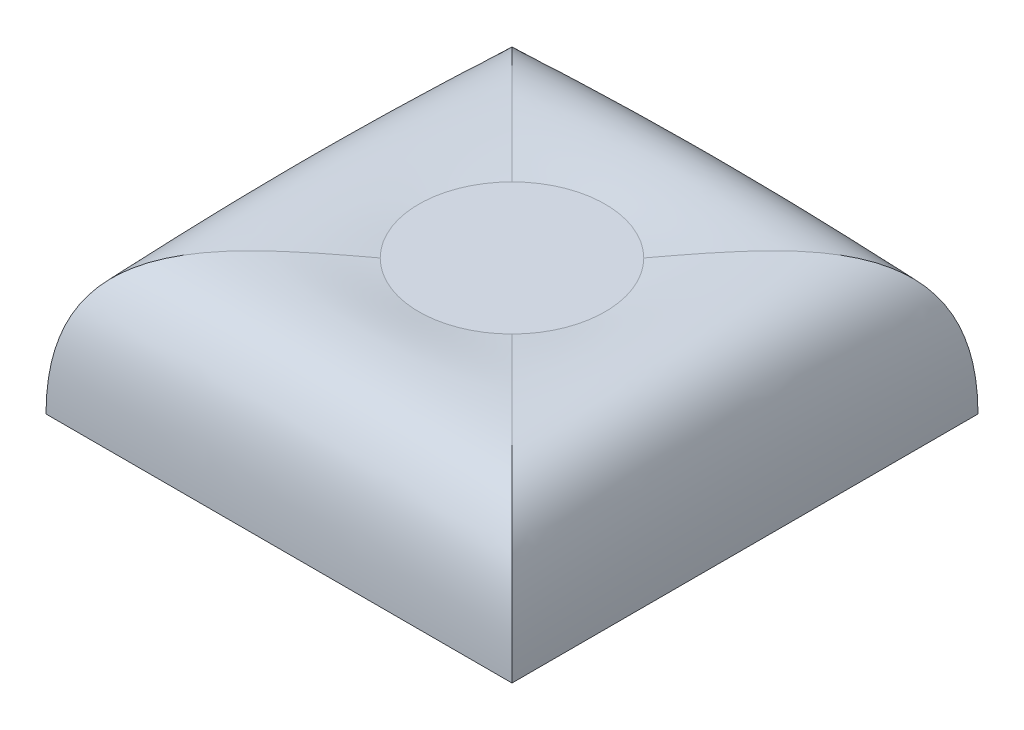
ISO-10303-21;
HEADER;
FILE_DESCRIPTION(('STEP AP214'),'2;1');
FILE_NAME('part.step','',(''),(''),'','','');
FILE_SCHEMA(('AUTOMOTIVE_DESIGN { 1 0 10303 214 1 1 1 1 }'));
ENDSEC;
DATA;
#1=APPLICATION_CONTEXT('core data for automotive mechanical design processes');
#2=APPLICATION_PROTOCOL_DEFINITION('international standard','automotive_design',2000,#1);
#3=PRODUCT_CONTEXT('',#1,'mechanical');
#4=PRODUCT('Part','Part','',(#3));
#5=PRODUCT_RELATED_PRODUCT_CATEGORY('part','',(#4));
#6=PRODUCT_DEFINITION_FORMATION('','',#4);
#7=PRODUCT_DEFINITION_CONTEXT('part definition',#1,'design');
#8=PRODUCT_DEFINITION('design','',#6,#7);
#9=PRODUCT_DEFINITION_SHAPE('','',#8);
#10=(LENGTH_UNIT() NAMED_UNIT(*) SI_UNIT(.MILLI.,.METRE.));
#11=(NAMED_UNIT(*) PLANE_ANGLE_UNIT() SI_UNIT($,.RADIAN.));
#12=(NAMED_UNIT(*) SI_UNIT($,.STERADIAN.) SOLID_ANGLE_UNIT());
#13=UNCERTAINTY_MEASURE_WITH_UNIT(LENGTH_MEASURE(1.E-05),#10,'distance_accuracy_value','');
#14=(GEOMETRIC_REPRESENTATION_CONTEXT(3) GLOBAL_UNCERTAINTY_ASSIGNED_CONTEXT((#13)) GLOBAL_UNIT_ASSIGNED_CONTEXT((#10,
#11,#12)) REPRESENTATION_CONTEXT('',''));
#15=CARTESIAN_POINT('',(0.,0.,0.));
#16=DIRECTION('',(0.,0.,1.));
#17=DIRECTION('',(1.,0.,0.));
#18=AXIS2_PLACEMENT_3D('',#15,#16,#17);
#19=CARTESIAN_POINT('',(0.,2.9,0.));
#20=DIRECTION('',(0.,1.,0.));
#21=DIRECTION('',(0.,0.,1.));
#22=AXIS2_PLACEMENT_3D('',#19,#20,#21);
#23=PLANE('',#22);
#24=CARTESIAN_POINT('',(0.,2.9,0.));
#25=DIRECTION('',(0.,1.,0.));
#26=DIRECTION('',(0.,0.,1.));
#27=AXIS2_PLACEMENT_3D('',#24,#25,#26);
#28=CIRCLE('',#27,2.);
#29=CARTESIAN_POINT('',(1.41421356237309,2.9,1.4142135623731));
#30=VERTEX_POINT('',#29);
#31=CARTESIAN_POINT('',(1.4142135623731,2.9,-1.41421356237309));
#32=VERTEX_POINT('',#31);
#33=EDGE_CURVE('E126',#30,#32,#28,.T.);
#34=ORIENTED_EDGE('',*,*,#33,.T.);
#35=CARTESIAN_POINT('',(-1.41421356237309,2.9,-1.4142135623731));
#36=VERTEX_POINT('',#35);
#37=EDGE_CURVE('E121',#32,#36,#28,.T.);
#38=ORIENTED_EDGE('',*,*,#37,.T.);
#39=CARTESIAN_POINT('',(-1.4142135623731,2.9,1.41421356237309));
#40=VERTEX_POINT('',#39);
#41=EDGE_CURVE('E144',#36,#40,#28,.T.);
#42=ORIENTED_EDGE('',*,*,#41,.T.);
#43=EDGE_CURVE('E129',#40,#30,#28,.T.);
#44=ORIENTED_EDGE('',*,*,#43,.T.);
#45=EDGE_LOOP('',(#34,#38,#42,#44));
#46=FACE_BOUND('',#45,.T.);
#47=ADVANCED_FACE('F81',(#46),#23,.T.);
#48=CARTESIAN_POINT('',(0.,0.,0.));
#49=DIRECTION('',(0.,1.,0.));
#50=DIRECTION('',(0.,0.,1.));
#51=AXIS2_PLACEMENT_3D('',#48,#49,#50);
#52=PLANE('',#51);
#53=DIRECTION('',(0.,0.,-1.));
#54=VECTOR('',#53,1.);
#55=CARTESIAN_POINT('',(5.,0.,-5.));
#56=LINE('',#55,#54);
#57=CARTESIAN_POINT('',(5.,0.,5.));
#58=VERTEX_POINT('',#57);
#59=CARTESIAN_POINT('',(5.,0.,-5.));
#60=VERTEX_POINT('',#59);
#61=EDGE_CURVE('E149',#58,#60,#56,.T.);
#62=ORIENTED_EDGE('',*,*,#61,.F.);
#63=DIRECTION('',(1.,0.,0.));
#64=VECTOR('',#63,1.);
#65=CARTESIAN_POINT('',(-5.,0.,5.));
#66=LINE('',#65,#64);
#67=CARTESIAN_POINT('',(-5.,0.,5.));
#68=VERTEX_POINT('',#67);
#69=EDGE_CURVE('E283',#68,#58,#66,.T.);
#70=ORIENTED_EDGE('',*,*,#69,.F.);
#71=DIRECTION('',(0.,0.,1.));
#72=VECTOR('',#71,1.);
#73=CARTESIAN_POINT('',(-5.,0.,-5.));
#74=LINE('',#73,#72);
#75=CARTESIAN_POINT('',(-5.,0.,-5.));
#76=VERTEX_POINT('',#75);
#77=EDGE_CURVE('E92',#76,#68,#74,.T.);
#78=ORIENTED_EDGE('',*,*,#77,.F.);
#79=DIRECTION('',(-1.,0.,0.));
#80=VECTOR('',#79,1.);
#81=CARTESIAN_POINT('',(-5.,0.,-5.));
#82=LINE('',#81,#80);
#83=EDGE_CURVE('E12',#60,#76,#82,.T.);
#84=ORIENTED_EDGE('',*,*,#83,.F.);
#85=EDGE_LOOP('',(#62,#70,#78,#84));
#86=FACE_BOUND('',#85,.T.);
#87=ADVANCED_FACE('F258',(#86),#52,.F.);
#88=CARTESIAN_POINT('',(-5.,0.,5.));
#89=CARTESIAN_POINT('',(-5.,3.40767180710832,5.));
#90=CARTESIAN_POINT('',(-3.20710678118655,3.15383590355416,3.20710678118655));
#91=CARTESIAN_POINT('',(-1.4142135623731,2.9,1.41421356237309));
#92=CARTESIAN_POINT('',(-1.66666666666667,0.,5.));
#93=CARTESIAN_POINT('',(-1.66666666666667,3.40767180710832,5.));
#94=CARTESIAN_POINT('',(-1.15017726836462,3.15383590355416,3.59736962734181));
#95=CARTESIAN_POINT('',(-0.633687870062566,2.9,2.19473925468362));
#96=CARTESIAN_POINT('',(1.66666666666667,0.,5.));
#97=CARTESIAN_POINT('',(1.66666666666667,3.40767180710832,5.));
#98=CARTESIAN_POINT('',(1.15017726836462,3.15383590355416,3.59736962734181));
#99=CARTESIAN_POINT('',(0.633687870062565,2.9,2.19473925468362));
#100=CARTESIAN_POINT('',(5.,0.,5.));
#101=CARTESIAN_POINT('',(5.,3.40767180710832,5.));
#102=CARTESIAN_POINT('',(3.20710678118655,3.15383590355416,3.20710678118655));
#103=CARTESIAN_POINT('',(1.41421356237309,2.9,1.4142135623731));
#104=B_SPLINE_SURFACE_WITH_KNOTS('',3,3,((#88,#89,#90,#91),(#92,#93,#94,#95),(#96,#97,#98,#99),
(#100,#101,#102,#103)),.UNSPECIFIED.,.F.,.F.,.F.,(4,4),(4,4),(0.,1.),(0.,1.),.UNSPECIFIED.);
#105=CARTESIAN_POINT('',(5.,0.,5.));
#106=CARTESIAN_POINT('',(5.,3.40767180710832,5.));
#107=CARTESIAN_POINT('',(3.20710678118655,3.15383590355416,3.20710678118655));
#108=CARTESIAN_POINT('',(1.41421356237309,2.9,1.4142135623731));
#109=B_SPLINE_CURVE_WITH_KNOTS('',3,(#105,#106,#107,#108),.UNSPECIFIED.,.F.,.F.,(4,4),(0.,1.),.UNSPECIFIED.);
#110=EDGE_CURVE('E154',#58,#30,#109,.T.);
#111=CARTESIAN_POINT('',(-5.,0.,5.));
#112=CARTESIAN_POINT('',(-5.,3.40767180710832,5.));
#113=CARTESIAN_POINT('',(-3.20710678118655,3.15383590355416,3.20710678118655));
#114=CARTESIAN_POINT('',(-1.4142135623731,2.9,1.41421356237309));
#115=B_SPLINE_CURVE_WITH_KNOTS('',3,(#111,#112,#113,#114),.UNSPECIFIED.,.F.,.F.,(4,4),(0.,1.),.UNSPECIFIED.);
#116=EDGE_CURVE('E151',#40,#68,#115,.F.);
#117=CARTESIAN_POINT('',(-5.,0.,5.));
#118=CARTESIAN_POINT('',(-5.,3.40767180710832,5.));
#119=CARTESIAN_POINT('',(-3.20710678118655,3.15383590355416,3.20710678118655));
#120=CARTESIAN_POINT('',(-1.4142135623731,2.9,1.41421356237309));
#121=CARTESIAN_POINT('',(-1.41406654512915,2.89997918545591,1.41406654512915));
#122=CARTESIAN_POINT('',(-1.41391952788521,2.89995837091182,1.41391952788521));
#123=CARTESIAN_POINT('',(-1.41377251064127,2.89993755636773,1.41377251064127));
#124=CARTESIAN_POINT('',(-1.66666666666667,0.,5.));
#125=CARTESIAN_POINT('',(-1.66666666666667,3.40767180710832,5.));
#126=CARTESIAN_POINT('',(-1.15017726836462,3.15383590355416,3.59736962734181));
#127=CARTESIAN_POINT('',(-0.633687870062566,2.9,2.19473925468362));
#128=CARTESIAN_POINT('',(-0.633645517931905,2.89997918545591,2.19462423899307));
#129=CARTESIAN_POINT('',(-0.633603165801245,2.89995837091182,2.19450922330251));
#130=CARTESIAN_POINT('',(-0.633560813670584,2.89993755636773,2.19439420761195));
#131=CARTESIAN_POINT('',(1.66666666666667,0.,5.));
#132=CARTESIAN_POINT('',(1.66666666666667,3.40767180710832,5.));
#133=CARTESIAN_POINT('',(1.15017726836462,3.15383590355416,3.59736962734181));
#134=CARTESIAN_POINT('',(0.633687870062565,2.9,2.19473925468362));
#135=CARTESIAN_POINT('',(0.633645517931904,2.89997918545591,2.19462423899307));
#136=CARTESIAN_POINT('',(0.633603165801244,2.89995837091182,2.19450922330251));
#137=CARTESIAN_POINT('',(0.633560813670583,2.89993755636773,2.19439420761195));
#138=CARTESIAN_POINT('',(5.,0.,5.));
#139=CARTESIAN_POINT('',(5.,3.40767180710832,5.));
#140=CARTESIAN_POINT('',(3.20710678118655,3.15383590355416,3.20710678118655));
#141=CARTESIAN_POINT('',(1.41421356237309,2.9,1.4142135623731));
#142=CARTESIAN_POINT('',(1.41406654512915,2.89997918545591,1.41406654512915));
#143=CARTESIAN_POINT('',(1.41391952788521,2.89995837091182,1.41391952788521));
#144=CARTESIAN_POINT('',(1.41377251064127,2.89993755636773,1.41377251064127));
#145=B_SPLINE_SURFACE_WITH_KNOTS('',3,3,((#117,#118,#119,#120,#121,#122,#123),(#124,#125,#126,
#127,#128,#129,#130),(#131,#132,#133,#134,#135,#136,#137),(#138,#139,#140,#141,#142,#143,#144)),
.UNSPECIFIED.,.F.,.F.,.F.,(4,4),(4,3,4),(0.,1.),(0.,1.,1.000082),.UNSPECIFIED.);
#146=ORIENTED_EDGE('',*,*,#69,.T.);
#147=ORIENTED_EDGE('',*,*,#110,.T.);
#148=ORIENTED_EDGE('',*,*,#43,.F.);
#149=ORIENTED_EDGE('',*,*,#116,.T.);
#150=EDGE_LOOP('',(#146,#147,#148,#149));
#151=FACE_BOUND('',#150,.T.);
#152=ADVANCED_FACE('F241',(#151),#145,.T.);
#153=CARTESIAN_POINT('',(5.,0.,5.));
#154=CARTESIAN_POINT('',(5.,3.40767180710832,5.));
#155=CARTESIAN_POINT('',(3.20710678118655,3.15383590355416,3.20710678118655));
#156=CARTESIAN_POINT('',(1.41421356237309,2.9,1.4142135623731));
#157=CARTESIAN_POINT('',(5.,0.,1.66666666666667));
#158=CARTESIAN_POINT('',(5.,3.40767180710832,1.66666666666667));
#159=CARTESIAN_POINT('',(3.59736962734181,3.15383590355416,1.15017726836462));
#160=CARTESIAN_POINT('',(2.19473925468362,2.9,0.633687870062566));
#161=CARTESIAN_POINT('',(5.,0.,-1.66666666666667));
#162=CARTESIAN_POINT('',(5.,3.40767180710832,-1.66666666666667));
#163=CARTESIAN_POINT('',(3.59736962734181,3.15383590355416,-1.15017726836462));
#164=CARTESIAN_POINT('',(2.19473925468362,2.9,-0.633687870062566));
#165=CARTESIAN_POINT('',(5.,0.,-5.));
#166=CARTESIAN_POINT('',(5.,3.40767180710832,-5.));
#167=CARTESIAN_POINT('',(3.20710678118655,3.15383590355416,-3.20710678118655));
#168=CARTESIAN_POINT('',(1.4142135623731,2.9,-1.41421356237309));
#169=B_SPLINE_SURFACE_WITH_KNOTS('',3,3,((#153,#154,#155,#156),(#157,#158,#159,#160),(#161,#162,
#163,#164),(#165,#166,#167,#168)),.UNSPECIFIED.,.F.,.F.,.F.,(4,4),(4,4),(0.,1.),(0.,1.),.UNSPECIFIED.);
#170=CARTESIAN_POINT('',(5.,0.,-5.));
#171=CARTESIAN_POINT('',(5.,3.40767180710832,-5.));
#172=CARTESIAN_POINT('',(3.20710678118655,3.15383590355416,-3.20710678118655));
#173=CARTESIAN_POINT('',(1.4142135623731,2.9,-1.41421356237309));
#174=B_SPLINE_CURVE_WITH_KNOTS('',3,(#170,#171,#172,#173),.UNSPECIFIED.,.F.,.F.,(4,4),(0.,1.),.UNSPECIFIED.);
#175=EDGE_CURVE('E143',#60,#32,#174,.T.);
#176=CARTESIAN_POINT('',(5.,0.,5.));
#177=CARTESIAN_POINT('',(5.,3.40767180710832,5.));
#178=CARTESIAN_POINT('',(3.20710678118655,3.15383590355416,3.20710678118655));
#179=CARTESIAN_POINT('',(1.41421356237309,2.9,1.4142135623731));
#180=CARTESIAN_POINT('',(1.41406654512915,2.89997918545591,1.41406654512915));
#181=CARTESIAN_POINT('',(1.41391952788521,2.89995837091182,1.41391952788521));
#182=CARTESIAN_POINT('',(1.41377251064127,2.89993755636773,1.41377251064127));
#183=CARTESIAN_POINT('',(5.,0.,1.66666666666667));
#184=CARTESIAN_POINT('',(5.,3.40767180710832,1.66666666666667));
#185=CARTESIAN_POINT('',(3.59736962734181,3.15383590355416,1.15017726836462));
#186=CARTESIAN_POINT('',(2.19473925468362,2.9,0.633687870062566));
#187=CARTESIAN_POINT('',(2.19462423899307,2.89997918545591,0.633645517931905));
#188=CARTESIAN_POINT('',(2.19450922330251,2.89995837091182,0.633603165801244));
#189=CARTESIAN_POINT('',(2.19439420761195,2.89993755636773,0.633560813670584));
#190=CARTESIAN_POINT('',(5.,0.,-1.66666666666667));
#191=CARTESIAN_POINT('',(5.,3.40767180710832,-1.66666666666667));
#192=CARTESIAN_POINT('',(3.59736962734181,3.15383590355416,-1.15017726836462));
#193=CARTESIAN_POINT('',(2.19473925468362,2.9,-0.633687870062566));
#194=CARTESIAN_POINT('',(2.19462423899307,2.89997918545591,-0.633645517931905));
#195=CARTESIAN_POINT('',(2.19450922330251,2.89995837091182,-0.633603165801244));
#196=CARTESIAN_POINT('',(2.19439420761195,2.89993755636773,-0.633560813670583));
#197=CARTESIAN_POINT('',(5.,0.,-5.));
#198=CARTESIAN_POINT('',(5.,3.40767180710832,-5.));
#199=CARTESIAN_POINT('',(3.20710678118655,3.15383590355416,-3.20710678118655));
#200=CARTESIAN_POINT('',(1.4142135623731,2.9,-1.41421356237309));
#201=CARTESIAN_POINT('',(1.41406654512915,2.89997918545591,-1.41406654512915));
#202=CARTESIAN_POINT('',(1.41391952788521,2.89995837091182,-1.41391952788521));
#203=CARTESIAN_POINT('',(1.41377251064127,2.89993755636773,-1.41377251064127));
#204=B_SPLINE_SURFACE_WITH_KNOTS('',3,3,((#176,#177,#178,#179,#180,#181,#182),(#183,#184,#185,
#186,#187,#188,#189),(#190,#191,#192,#193,#194,#195,#196),(#197,#198,#199,#200,#201,#202,#203)),
.UNSPECIFIED.,.F.,.F.,.F.,(4,4),(4,3,4),(0.,1.),(0.,1.,1.000082),.UNSPECIFIED.);
#205=ORIENTED_EDGE('',*,*,#61,.T.);
#206=ORIENTED_EDGE('',*,*,#175,.T.);
#207=ORIENTED_EDGE('',*,*,#33,.F.);
#208=ORIENTED_EDGE('',*,*,#110,.F.);
#209=EDGE_LOOP('',(#205,#206,#207,#208));
#210=FACE_BOUND('',#209,.T.);
#211=ADVANCED_FACE('F148',(#210),#204,.T.);
#212=CARTESIAN_POINT('',(-5.,0.,-5.));
#213=CARTESIAN_POINT('',(-5.,3.40767180710832,-5.));
#214=CARTESIAN_POINT('',(-3.20710678118655,3.15383590355416,-3.20710678118655));
#215=CARTESIAN_POINT('',(-1.41421356237309,2.9,-1.4142135623731));
#216=CARTESIAN_POINT('',(-5.,0.,-1.66666666666667));
#217=CARTESIAN_POINT('',(-5.,3.40767180710832,-1.66666666666667));
#218=CARTESIAN_POINT('',(-3.59736962734181,3.15383590355416,-1.15017726836462));
#219=CARTESIAN_POINT('',(-2.19473925468362,2.9,-0.633687870062566));
#220=CARTESIAN_POINT('',(-5.,0.,1.66666666666667));
#221=CARTESIAN_POINT('',(-5.,3.40767180710832,1.66666666666667));
#222=CARTESIAN_POINT('',(-3.59736962734181,3.15383590355416,1.15017726836462));
#223=CARTESIAN_POINT('',(-2.19473925468362,2.9,0.633687870062565));
#224=CARTESIAN_POINT('',(-5.,0.,5.));
#225=CARTESIAN_POINT('',(-5.,3.40767180710832,5.));
#226=CARTESIAN_POINT('',(-3.20710678118655,3.15383590355416,3.20710678118655));
#227=CARTESIAN_POINT('',(-1.4142135623731,2.9,1.41421356237309));
#228=B_SPLINE_SURFACE_WITH_KNOTS('',3,3,((#212,#213,#214,#215),(#216,#217,#218,#219),(#220,#221,
#222,#223),(#224,#225,#226,#227)),.UNSPECIFIED.,.F.,.F.,.F.,(4,4),(4,4),(0.,1.),(0.,1.),.UNSPECIFIED.);
#229=CARTESIAN_POINT('',(-5.,0.,-5.));
#230=CARTESIAN_POINT('',(-5.,3.40767180710832,-5.));
#231=CARTESIAN_POINT('',(-3.20710678118655,3.15383590355416,-3.20710678118655));
#232=CARTESIAN_POINT('',(-1.41421356237309,2.9,-1.4142135623731));
#233=B_SPLINE_CURVE_WITH_KNOTS('',3,(#229,#230,#231,#232),.UNSPECIFIED.,.F.,.F.,(4,4),(0.,1.),.UNSPECIFIED.);
#234=EDGE_CURVE('E134',#76,#36,#233,.T.);
#235=CARTESIAN_POINT('',(-5.,0.,-5.));
#236=CARTESIAN_POINT('',(-5.,3.40767180710832,-5.));
#237=CARTESIAN_POINT('',(-3.20710678118655,3.15383590355416,-3.20710678118655));
#238=CARTESIAN_POINT('',(-1.41421356237309,2.9,-1.4142135623731));
#239=CARTESIAN_POINT('',(-1.41406654512915,2.89997918545591,-1.41406654512915));
#240=CARTESIAN_POINT('',(-1.41391952788521,2.89995837091182,-1.41391952788521));
#241=CARTESIAN_POINT('',(-1.41377251064127,2.89993755636773,-1.41377251064127));
#242=CARTESIAN_POINT('',(-5.,0.,-1.66666666666667));
#243=CARTESIAN_POINT('',(-5.,3.40767180710832,-1.66666666666667));
#244=CARTESIAN_POINT('',(-3.59736962734181,3.15383590355416,-1.15017726836462));
#245=CARTESIAN_POINT('',(-2.19473925468362,2.9,-0.633687870062566));
#246=CARTESIAN_POINT('',(-2.19462423899307,2.89997918545591,-0.633645517931905));
#247=CARTESIAN_POINT('',(-2.19450922330251,2.89995837091182,-0.633603165801245));
#248=CARTESIAN_POINT('',(-2.19439420761195,2.89993755636773,-0.633560813670584));
#249=CARTESIAN_POINT('',(-5.,0.,1.66666666666667));
#250=CARTESIAN_POINT('',(-5.,3.40767180710832,1.66666666666667));
#251=CARTESIAN_POINT('',(-3.59736962734181,3.15383590355416,1.15017726836462));
#252=CARTESIAN_POINT('',(-2.19473925468362,2.9,0.633687870062565));
#253=CARTESIAN_POINT('',(-2.19462423899307,2.89997918545591,0.633645517931905));
#254=CARTESIAN_POINT('',(-2.19450922330251,2.89995837091182,0.633603165801244));
#255=CARTESIAN_POINT('',(-2.19439420761195,2.89993755636773,0.633560813670583));
#256=CARTESIAN_POINT('',(-5.,0.,5.));
#257=CARTESIAN_POINT('',(-5.,3.40767180710832,5.));
#258=CARTESIAN_POINT('',(-3.20710678118655,3.15383590355416,3.20710678118655));
#259=CARTESIAN_POINT('',(-1.4142135623731,2.9,1.41421356237309));
#260=CARTESIAN_POINT('',(-1.41406654512915,2.89997918545591,1.41406654512915));
#261=CARTESIAN_POINT('',(-1.41391952788521,2.89995837091182,1.41391952788521));
#262=CARTESIAN_POINT('',(-1.41377251064127,2.89993755636773,1.41377251064127));
#263=B_SPLINE_SURFACE_WITH_KNOTS('',3,3,((#235,#236,#237,#238,#239,#240,#241),(#242,#243,#244,
#245,#246,#247,#248),(#249,#250,#251,#252,#253,#254,#255),(#256,#257,#258,#259,#260,#261,#262)),
.UNSPECIFIED.,.F.,.F.,.F.,(4,4),(4,3,4),(0.,1.),(0.,1.,1.000082),.UNSPECIFIED.);
#264=ORIENTED_EDGE('',*,*,#77,.T.);
#265=ORIENTED_EDGE('',*,*,#116,.F.);
#266=ORIENTED_EDGE('',*,*,#41,.F.);
#267=ORIENTED_EDGE('',*,*,#234,.F.);
#268=EDGE_LOOP('',(#264,#265,#266,#267));
#269=FACE_BOUND('',#268,.T.);
#270=ADVANCED_FACE('F183',(#269),#263,.T.);
#271=CARTESIAN_POINT('',(5.,0.,-5.));
#272=CARTESIAN_POINT('',(5.,3.40767180710832,-5.));
#273=CARTESIAN_POINT('',(3.20710678118655,3.15383590355416,-3.20710678118655));
#274=CARTESIAN_POINT('',(1.4142135623731,2.9,-1.41421356237309));
#275=CARTESIAN_POINT('',(1.66666666666667,0.,-5.));
#276=CARTESIAN_POINT('',(1.66666666666667,3.40767180710832,-5.));
#277=CARTESIAN_POINT('',(1.15017726836462,3.15383590355416,-3.59736962734181));
#278=CARTESIAN_POINT('',(0.633687870062566,2.9,-2.19473925468362));
#279=CARTESIAN_POINT('',(-1.66666666666667,0.,-5.));
#280=CARTESIAN_POINT('',(-1.66666666666667,3.40767180710832,-5.));
#281=CARTESIAN_POINT('',(-1.15017726836462,3.15383590355416,-3.59736962734181));
#282=CARTESIAN_POINT('',(-0.633687870062566,2.9,-2.19473925468362));
#283=CARTESIAN_POINT('',(-5.,0.,-5.));
#284=CARTESIAN_POINT('',(-5.,3.40767180710832,-5.));
#285=CARTESIAN_POINT('',(-3.20710678118655,3.15383590355416,-3.20710678118655));
#286=CARTESIAN_POINT('',(-1.41421356237309,2.9,-1.4142135623731));
#287=B_SPLINE_SURFACE_WITH_KNOTS('',3,3,((#271,#272,#273,#274),(#275,#276,#277,#278),(#279,#280,
#281,#282),(#283,#284,#285,#286)),.UNSPECIFIED.,.F.,.F.,.F.,(4,4),(4,4),(0.,1.),(0.,1.),.UNSPECIFIED.);
#288=CARTESIAN_POINT('',(5.,0.,-5.));
#289=CARTESIAN_POINT('',(5.,3.40767180710832,-5.));
#290=CARTESIAN_POINT('',(3.20710678118655,3.15383590355416,-3.20710678118655));
#291=CARTESIAN_POINT('',(1.4142135623731,2.9,-1.41421356237309));
#292=CARTESIAN_POINT('',(1.41406654512915,2.89997918545591,-1.41406654512915));
#293=CARTESIAN_POINT('',(1.41391952788521,2.89995837091182,-1.41391952788521));
#294=CARTESIAN_POINT('',(1.41377251064127,2.89993755636773,-1.41377251064127));
#295=CARTESIAN_POINT('',(1.66666666666667,0.,-5.));
#296=CARTESIAN_POINT('',(1.66666666666667,3.40767180710832,-5.));
#297=CARTESIAN_POINT('',(1.15017726836462,3.15383590355416,-3.59736962734181));
#298=CARTESIAN_POINT('',(0.633687870062566,2.9,-2.19473925468362));
#299=CARTESIAN_POINT('',(0.633645517931905,2.89997918545591,-2.19462423899307));
#300=CARTESIAN_POINT('',(0.633603165801244,2.89995837091182,-2.19450922330251));
#301=CARTESIAN_POINT('',(0.633560813670584,2.89993755636773,-2.19439420761195));
#302=CARTESIAN_POINT('',(-1.66666666666667,0.,-5.));
#303=CARTESIAN_POINT('',(-1.66666666666667,3.40767180710832,-5.));
#304=CARTESIAN_POINT('',(-1.15017726836462,3.15383590355416,-3.59736962734181));
#305=CARTESIAN_POINT('',(-0.633687870062566,2.9,-2.19473925468362));
#306=CARTESIAN_POINT('',(-0.633645517931905,2.89997918545591,-2.19462423899307));
#307=CARTESIAN_POINT('',(-0.633603165801244,2.89995837091182,-2.19450922330251));
#308=CARTESIAN_POINT('',(-0.633560813670583,2.89993755636773,-2.19439420761195));
#309=CARTESIAN_POINT('',(-5.,0.,-5.));
#310=CARTESIAN_POINT('',(-5.,3.40767180710832,-5.));
#311=CARTESIAN_POINT('',(-3.20710678118655,3.15383590355416,-3.20710678118655));
#312=CARTESIAN_POINT('',(-1.41421356237309,2.9,-1.4142135623731));
#313=CARTESIAN_POINT('',(-1.41406654512915,2.89997918545591,-1.41406654512915));
#314=CARTESIAN_POINT('',(-1.41391952788521,2.89995837091182,-1.41391952788521));
#315=CARTESIAN_POINT('',(-1.41377251064127,2.89993755636773,-1.41377251064127));
#316=B_SPLINE_SURFACE_WITH_KNOTS('',3,3,((#288,#289,#290,#291,#292,#293,#294),(#295,#296,#297,
#298,#299,#300,#301),(#302,#303,#304,#305,#306,#307,#308),(#309,#310,#311,#312,#313,#314,#315)),
.UNSPECIFIED.,.F.,.F.,.F.,(4,4),(4,3,4),(0.,1.),(0.,1.,1.000082),.UNSPECIFIED.);
#317=ORIENTED_EDGE('',*,*,#83,.T.);
#318=ORIENTED_EDGE('',*,*,#234,.T.);
#319=ORIENTED_EDGE('',*,*,#37,.F.);
#320=ORIENTED_EDGE('',*,*,#175,.F.);
#321=EDGE_LOOP('',(#317,#318,#319,#320));
#322=FACE_BOUND('',#321,.T.);
#323=ADVANCED_FACE('F142',(#322),#316,.T.);
#324=CLOSED_SHELL('',(#47,#87,#152,#211,#270,#323));
#325=MANIFOLD_SOLID_BREP('B2',#324);
#326=ADVANCED_BREP_SHAPE_REPRESENTATION('',(#18,#325),#14);
#327=SHAPE_DEFINITION_REPRESENTATION(#9,#326);
ENDSEC;
END-ISO-10303-21;
